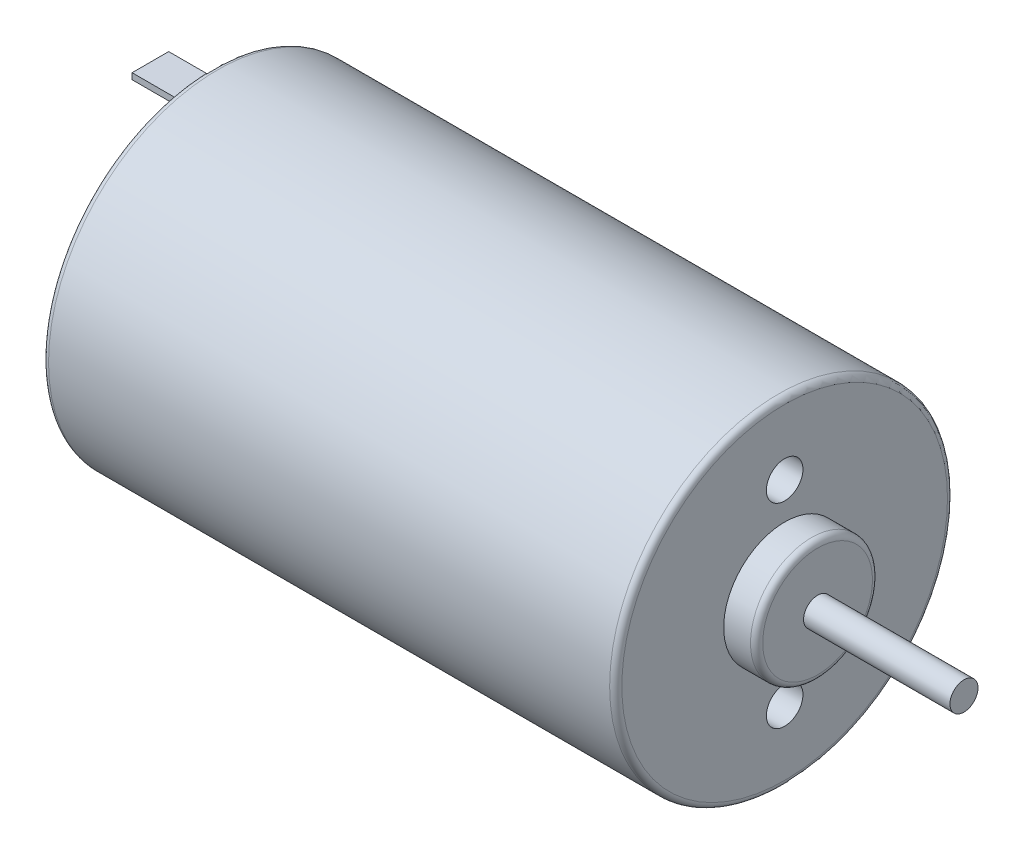
ISO-10303-21;
HEADER;
FILE_DESCRIPTION(('STEP AP214'),'2;1');
FILE_NAME('part.step','',(''),(''),'','','');
FILE_SCHEMA(('AUTOMOTIVE_DESIGN { 1 0 10303 214 1 1 1 1 }'));
ENDSEC;
DATA;
#1=APPLICATION_CONTEXT('core data for automotive mechanical design processes');
#2=APPLICATION_PROTOCOL_DEFINITION('international standard','automotive_design',2000,#1);
#3=PRODUCT_CONTEXT('',#1,'mechanical');
#4=PRODUCT('Part','Part','',(#3));
#5=PRODUCT_RELATED_PRODUCT_CATEGORY('part','',(#4));
#6=PRODUCT_DEFINITION_FORMATION('','',#4);
#7=PRODUCT_DEFINITION_CONTEXT('part definition',#1,'design');
#8=PRODUCT_DEFINITION('design','',#6,#7);
#9=PRODUCT_DEFINITION_SHAPE('','',#8);
#10=(LENGTH_UNIT() NAMED_UNIT(*) SI_UNIT(.MILLI.,.METRE.));
#11=(NAMED_UNIT(*) PLANE_ANGLE_UNIT() SI_UNIT($,.RADIAN.));
#12=(NAMED_UNIT(*) SI_UNIT($,.STERADIAN.) SOLID_ANGLE_UNIT());
#13=UNCERTAINTY_MEASURE_WITH_UNIT(LENGTH_MEASURE(1.E-05),#10,'distance_accuracy_value','');
#14=(GEOMETRIC_REPRESENTATION_CONTEXT(3) GLOBAL_UNCERTAINTY_ASSIGNED_CONTEXT((#13)) GLOBAL_UNIT_ASSIGNED_CONTEXT((#10,
#11,#12)) REPRESENTATION_CONTEXT('',''));
#15=CARTESIAN_POINT('',(0.,0.,0.));
#16=DIRECTION('',(0.,0.,1.));
#17=DIRECTION('',(1.,0.,0.));
#18=AXIS2_PLACEMENT_3D('',#15,#16,#17);
#19=CARTESIAN_POINT('',(0.,0.,0.));
#20=DIRECTION('',(1.,0.,0.));
#21=DIRECTION('',(0.,0.,-1.));
#22=AXIS2_PLACEMENT_3D('',#19,#20,#21);
#23=PLANE('',#22);
#24=CARTESIAN_POINT('',(0.,0.,0.));
#25=DIRECTION('',(1.,0.,0.));
#26=DIRECTION('',(0.,0.,-1.));
#27=AXIS2_PLACEMENT_3D('',#24,#25,#26);
#28=CIRCLE('',#27,13.35);
#29=CARTESIAN_POINT('',(0.,0.,-13.35));
#30=VERTEX_POINT('',#29);
#31=EDGE_CURVE('E50',#30,#30,#28,.F.);
#32=ORIENTED_EDGE('',*,*,#31,.T.);
#33=EDGE_LOOP('',(#32));
#34=FACE_BOUND('',#33,.T.);
#35=DIRECTION('',(0.,1.,0.));
#36=VECTOR('',#35,1.);
#37=CARTESIAN_POINT('',(0.,11.65,1.5));
#38=LINE('',#37,#36);
#39=CARTESIAN_POINT('',(0.,11.15,1.5));
#40=VERTEX_POINT('',#39);
#41=CARTESIAN_POINT('',(0.,11.65,1.5));
#42=VERTEX_POINT('',#41);
#43=EDGE_CURVE('E131',#40,#42,#38,.T.);
#44=ORIENTED_EDGE('',*,*,#43,.F.);
#45=DIRECTION('',(0.,0.,1.));
#46=VECTOR('',#45,1.);
#47=CARTESIAN_POINT('',(0.,11.15,-1.5));
#48=LINE('',#47,#46);
#49=CARTESIAN_POINT('',(0.,11.15,-1.5));
#50=VERTEX_POINT('',#49);
#51=EDGE_CURVE('E147',#50,#40,#48,.T.);
#52=ORIENTED_EDGE('',*,*,#51,.F.);
#53=DIRECTION('',(0.,-1.,0.));
#54=VECTOR('',#53,1.);
#55=CARTESIAN_POINT('',(0.,11.65,-1.5));
#56=LINE('',#55,#54);
#57=CARTESIAN_POINT('',(0.,11.65,-1.5));
#58=VERTEX_POINT('',#57);
#59=EDGE_CURVE('E160',#58,#50,#56,.T.);
#60=ORIENTED_EDGE('',*,*,#59,.F.);
#61=DIRECTION('',(0.,0.,-1.));
#62=VECTOR('',#61,1.);
#63=CARTESIAN_POINT('',(0.,11.65,-1.5));
#64=LINE('',#63,#62);
#65=EDGE_CURVE('E136',#42,#58,#64,.T.);
#66=ORIENTED_EDGE('',*,*,#65,.F.);
#67=EDGE_LOOP('',(#44,#52,#60,#66));
#68=FACE_BOUND('',#67,.T.);
#69=CARTESIAN_POINT('',(0.,0.,0.));
#70=DIRECTION('',(-1.,0.,0.));
#71=DIRECTION('',(0.,0.,1.));
#72=AXIS2_PLACEMENT_3D('',#69,#70,#71);
#73=CIRCLE('',#72,5.);
#74=CARTESIAN_POINT('',(0.,0.,5.));
#75=VERTEX_POINT('',#74);
#76=EDGE_CURVE('E192',#75,#75,#73,.T.);
#77=ORIENTED_EDGE('',*,*,#76,.F.);
#78=EDGE_LOOP('',(#77));
#79=FACE_BOUND('',#78,.T.);
#80=DIRECTION('',(0.,-1.,0.));
#81=VECTOR('',#80,1.);
#82=CARTESIAN_POINT('',(0.,-11.65,-1.5));
#83=LINE('',#82,#81);
#84=CARTESIAN_POINT('',(0.,-11.15,-1.5));
#85=VERTEX_POINT('',#84);
#86=CARTESIAN_POINT('',(0.,-11.65,-1.5));
#87=VERTEX_POINT('',#86);
#88=EDGE_CURVE('E129',#85,#87,#83,.T.);
#89=ORIENTED_EDGE('',*,*,#88,.F.);
#90=DIRECTION('',(0.,0.,-1.));
#91=VECTOR('',#90,1.);
#92=CARTESIAN_POINT('',(0.,-11.15,-1.5));
#93=LINE('',#92,#91);
#94=CARTESIAN_POINT('',(0.,-11.15,1.5));
#95=VERTEX_POINT('',#94);
#96=EDGE_CURVE('E126',#95,#85,#93,.T.);
#97=ORIENTED_EDGE('',*,*,#96,.F.);
#98=DIRECTION('',(0.,1.,0.));
#99=VECTOR('',#98,1.);
#100=CARTESIAN_POINT('',(0.,-11.65,1.5));
#101=LINE('',#100,#99);
#102=CARTESIAN_POINT('',(0.,-11.65,1.5));
#103=VERTEX_POINT('',#102);
#104=EDGE_CURVE('E62',#103,#95,#101,.T.);
#105=ORIENTED_EDGE('',*,*,#104,.F.);
#106=DIRECTION('',(0.,0.,1.));
#107=VECTOR('',#106,1.);
#108=CARTESIAN_POINT('',(0.,-11.65,-1.5));
#109=LINE('',#108,#107);
#110=EDGE_CURVE('E57',#87,#103,#109,.T.);
#111=ORIENTED_EDGE('',*,*,#110,.F.);
#112=EDGE_LOOP('',(#89,#97,#105,#111));
#113=FACE_BOUND('',#112,.T.);
#114=ADVANCED_FACE('F41',(#34,#68,#79,#113),#23,.F.);
#115=CARTESIAN_POINT('',(47.,0.,0.));
#116=DIRECTION('',(-1.,0.,0.));
#117=DIRECTION('',(0.,0.,1.));
#118=AXIS2_PLACEMENT_3D('',#115,#116,#117);
#119=CYLINDRICAL_SURFACE('',#118,13.85);
#120=CARTESIAN_POINT('',(0.5,0.,0.));
#121=DIRECTION('',(1.,0.,0.));
#122=DIRECTION('',(0.,0.,-1.));
#123=AXIS2_PLACEMENT_3D('',#120,#121,#122);
#124=CIRCLE('',#123,13.85);
#125=CARTESIAN_POINT('',(0.5,0.,-13.85));
#126=VERTEX_POINT('',#125);
#127=EDGE_CURVE('E226',#126,#126,#124,.T.);
#128=ORIENTED_EDGE('',*,*,#127,.T.);
#129=EDGE_LOOP('',(#128));
#130=FACE_BOUND('',#129,.T.);
#131=CARTESIAN_POINT('',(46.5,0.,0.));
#132=DIRECTION('',(1.,0.,0.));
#133=DIRECTION('',(0.,0.,-1.));
#134=AXIS2_PLACEMENT_3D('',#131,#132,#133);
#135=CIRCLE('',#134,13.85);
#136=CARTESIAN_POINT('',(46.5,0.,-13.85));
#137=VERTEX_POINT('',#136);
#138=EDGE_CURVE('E222',#137,#137,#135,.F.);
#139=ORIENTED_EDGE('',*,*,#138,.T.);
#140=EDGE_LOOP('',(#139));
#141=FACE_BOUND('',#140,.T.);
#142=ADVANCED_FACE('F241',(#130,#141),#119,.T.);
#143=CARTESIAN_POINT('',(47.,0.,0.));
#144=DIRECTION('',(1.,0.,0.));
#145=DIRECTION('',(0.,0.,-1.));
#146=AXIS2_PLACEMENT_3D('',#143,#144,#145);
#147=PLANE('',#146);
#148=CARTESIAN_POINT('',(47.,0.,0.));
#149=DIRECTION('',(1.,0.,0.));
#150=DIRECTION('',(0.,0.,-1.));
#151=AXIS2_PLACEMENT_3D('',#148,#149,#150);
#152=CIRCLE('',#151,13.35);
#153=CARTESIAN_POINT('',(47.,0.,-13.35));
#154=VERTEX_POINT('',#153);
#155=EDGE_CURVE('E11',#154,#154,#152,.T.);
#156=ORIENTED_EDGE('',*,*,#155,.T.);
#157=EDGE_LOOP('',(#156));
#158=FACE_BOUND('',#157,.T.);
#159=CARTESIAN_POINT('',(47.,8.,0.));
#160=DIRECTION('',(1.,0.,0.));
#161=DIRECTION('',(0.,0.,-1.));
#162=AXIS2_PLACEMENT_3D('',#159,#160,#161);
#163=CIRCLE('',#162,1.5);
#164=CARTESIAN_POINT('',(47.,8.,-1.5));
#165=VERTEX_POINT('',#164);
#166=EDGE_CURVE('E259',#165,#165,#163,.T.);
#167=ORIENTED_EDGE('',*,*,#166,.F.);
#168=EDGE_LOOP('',(#167));
#169=FACE_BOUND('',#168,.T.);
#170=CARTESIAN_POINT('',(47.,-8.,0.));
#171=DIRECTION('',(1.,0.,0.));
#172=DIRECTION('',(0.,0.,1.));
#173=AXIS2_PLACEMENT_3D('',#170,#171,#172);
#174=CIRCLE('',#173,1.5);
#175=CARTESIAN_POINT('',(47.,-8.,1.5));
#176=VERTEX_POINT('',#175);
#177=EDGE_CURVE('E263',#176,#176,#174,.T.);
#178=ORIENTED_EDGE('',*,*,#177,.F.);
#179=EDGE_LOOP('',(#178));
#180=FACE_BOUND('',#179,.T.);
#181=CARTESIAN_POINT('',(47.,0.,0.));
#182=DIRECTION('',(1.,0.,0.));
#183=DIRECTION('',(0.,0.,-1.));
#184=AXIS2_PLACEMENT_3D('',#181,#182,#183);
#185=CIRCLE('',#184,5.);
#186=CARTESIAN_POINT('',(47.,0.,-5.));
#187=VERTEX_POINT('',#186);
#188=EDGE_CURVE('E200',#187,#187,#185,.T.);
#189=ORIENTED_EDGE('',*,*,#188,.F.);
#190=EDGE_LOOP('',(#189));
#191=FACE_BOUND('',#190,.T.);
#192=ADVANCED_FACE('F244',(#158,#169,#180,#191),#147,.T.);
#193=CARTESIAN_POINT('',(49.7,0.,0.));
#194=DIRECTION('',(-1.,0.,0.));
#195=DIRECTION('',(0.,0.,1.));
#196=AXIS2_PLACEMENT_3D('',#193,#194,#195);
#197=CYLINDRICAL_SURFACE('',#196,5.);
#198=CARTESIAN_POINT('',(49.2,0.,0.));
#199=DIRECTION('',(1.,0.,0.));
#200=DIRECTION('',(0.,0.,-1.));
#201=AXIS2_PLACEMENT_3D('',#198,#199,#200);
#202=CIRCLE('',#201,5.);
#203=CARTESIAN_POINT('',(49.2,0.,-5.));
#204=VERTEX_POINT('',#203);
#205=EDGE_CURVE('E210',#204,#204,#202,.F.);
#206=ORIENTED_EDGE('',*,*,#205,.T.);
#207=EDGE_LOOP('',(#206));
#208=FACE_BOUND('',#207,.T.);
#209=ORIENTED_EDGE('',*,*,#188,.T.);
#210=EDGE_LOOP('',(#209));
#211=FACE_BOUND('',#210,.T.);
#212=ADVANCED_FACE('F254',(#208,#211),#197,.T.);
#213=CARTESIAN_POINT('',(49.7,0.,0.));
#214=DIRECTION('',(1.,0.,0.));
#215=DIRECTION('',(0.,0.,-1.));
#216=AXIS2_PLACEMENT_3D('',#213,#214,#215);
#217=PLANE('',#216);
#218=CARTESIAN_POINT('',(49.7,0.,0.));
#219=DIRECTION('',(1.,0.,0.));
#220=DIRECTION('',(0.,0.,-1.));
#221=AXIS2_PLACEMENT_3D('',#218,#219,#220);
#222=CIRCLE('',#221,4.5);
#223=CARTESIAN_POINT('',(49.7,0.,-4.5));
#224=VERTEX_POINT('',#223);
#225=EDGE_CURVE('E191',#224,#224,#222,.T.);
#226=ORIENTED_EDGE('',*,*,#225,.T.);
#227=EDGE_LOOP('',(#226));
#228=FACE_BOUND('',#227,.T.);
#229=CARTESIAN_POINT('',(49.7,0.,0.));
#230=DIRECTION('',(1.,0.,0.));
#231=DIRECTION('',(0.,0.,-1.));
#232=AXIS2_PLACEMENT_3D('',#229,#230,#231);
#233=CIRCLE('',#232,1.15);
#234=CARTESIAN_POINT('',(49.7,0.,-1.15));
#235=VERTEX_POINT('',#234);
#236=EDGE_CURVE('E196',#235,#235,#233,.T.);
#237=ORIENTED_EDGE('',*,*,#236,.F.);
#238=EDGE_LOOP('',(#237));
#239=FACE_BOUND('',#238,.T.);
#240=ADVANCED_FACE('F267',(#228,#239),#217,.T.);
#241=CARTESIAN_POINT('',(61.7,0.,0.));
#242=DIRECTION('',(-1.,0.,0.));
#243=DIRECTION('',(0.,0.,1.));
#244=AXIS2_PLACEMENT_3D('',#241,#242,#243);
#245=CYLINDRICAL_SURFACE('',#244,1.15);
#246=CARTESIAN_POINT('',(61.7,0.,0.));
#247=DIRECTION('',(1.,0.,0.));
#248=DIRECTION('',(0.,0.,-1.));
#249=AXIS2_PLACEMENT_3D('',#246,#247,#248);
#250=CIRCLE('',#249,1.15);
#251=CARTESIAN_POINT('',(61.7,0.,-1.15));
#252=VERTEX_POINT('',#251);
#253=EDGE_CURVE('E186',#252,#252,#250,.T.);
#254=ORIENTED_EDGE('',*,*,#253,.F.);
#255=EDGE_LOOP('',(#254));
#256=FACE_BOUND('',#255,.T.);
#257=ORIENTED_EDGE('',*,*,#236,.T.);
#258=EDGE_LOOP('',(#257));
#259=FACE_BOUND('',#258,.T.);
#260=ADVANCED_FACE('F273',(#256,#259),#245,.T.);
#261=CARTESIAN_POINT('',(61.7,0.,0.));
#262=DIRECTION('',(1.,0.,0.));
#263=DIRECTION('',(0.,0.,-1.));
#264=AXIS2_PLACEMENT_3D('',#261,#262,#263);
#265=PLANE('',#264);
#266=ORIENTED_EDGE('',*,*,#253,.T.);
#267=EDGE_LOOP('',(#266));
#268=FACE_BOUND('',#267,.T.);
#269=ADVANCED_FACE('F317',(#268),#265,.T.);
#270=CARTESIAN_POINT('',(-2.,0.,0.));
#271=DIRECTION('',(1.,0.,0.));
#272=DIRECTION('',(0.,0.,-1.));
#273=AXIS2_PLACEMENT_3D('',#270,#271,#272);
#274=CYLINDRICAL_SURFACE('',#273,5.);
#275=CARTESIAN_POINT('',(-1.5,0.,0.));
#276=DIRECTION('',(-1.,0.,0.));
#277=DIRECTION('',(0.,0.,1.));
#278=AXIS2_PLACEMENT_3D('',#275,#276,#277);
#279=CIRCLE('',#278,5.);
#280=CARTESIAN_POINT('',(-1.5,0.,5.));
#281=VERTEX_POINT('',#280);
#282=EDGE_CURVE('E218',#281,#281,#279,.F.);
#283=ORIENTED_EDGE('',*,*,#282,.T.);
#284=EDGE_LOOP('',(#283));
#285=FACE_BOUND('',#284,.T.);
#286=ORIENTED_EDGE('',*,*,#76,.T.);
#287=EDGE_LOOP('',(#286));
#288=FACE_BOUND('',#287,.T.);
#289=ADVANCED_FACE('F298',(#285,#288),#274,.T.);
#290=CARTESIAN_POINT('',(-2.,0.,0.));
#291=DIRECTION('',(-1.,0.,0.));
#292=DIRECTION('',(0.,0.,1.));
#293=AXIS2_PLACEMENT_3D('',#290,#291,#292);
#294=PLANE('',#293);
#295=CARTESIAN_POINT('',(-2.,0.,0.));
#296=DIRECTION('',(-1.,0.,0.));
#297=DIRECTION('',(0.,0.,1.));
#298=AXIS2_PLACEMENT_3D('',#295,#296,#297);
#299=CIRCLE('',#298,4.5);
#300=CARTESIAN_POINT('',(-2.,0.,4.5));
#301=VERTEX_POINT('',#300);
#302=EDGE_CURVE('E214',#301,#301,#299,.T.);
#303=ORIENTED_EDGE('',*,*,#302,.T.);
#304=EDGE_LOOP('',(#303));
#305=FACE_BOUND('',#304,.T.);
#306=CARTESIAN_POINT('',(-2.,0.,0.));
#307=DIRECTION('',(-1.,0.,0.));
#308=DIRECTION('',(0.,0.,1.));
#309=AXIS2_PLACEMENT_3D('',#306,#307,#308);
#310=CIRCLE('',#309,1.15);
#311=CARTESIAN_POINT('',(-2.,0.,1.15));
#312=VERTEX_POINT('',#311);
#313=EDGE_CURVE('E187',#312,#312,#310,.T.);
#314=ORIENTED_EDGE('',*,*,#313,.F.);
#315=EDGE_LOOP('',(#314));
#316=FACE_BOUND('',#315,.T.);
#317=ADVANCED_FACE('F294',(#305,#316),#294,.T.);
#318=CARTESIAN_POINT('',(-2.75,0.,0.));
#319=DIRECTION('',(1.,0.,0.));
#320=DIRECTION('',(0.,0.,-1.));
#321=AXIS2_PLACEMENT_3D('',#318,#319,#320);
#322=CYLINDRICAL_SURFACE('',#321,1.15);
#323=CARTESIAN_POINT('',(-2.75,0.,0.));
#324=DIRECTION('',(-1.,0.,0.));
#325=DIRECTION('',(0.,0.,1.));
#326=AXIS2_PLACEMENT_3D('',#323,#324,#325);
#327=CIRCLE('',#326,1.15);
#328=CARTESIAN_POINT('',(-2.75,0.,1.15));
#329=VERTEX_POINT('',#328);
#330=EDGE_CURVE('E182',#329,#329,#327,.T.);
#331=ORIENTED_EDGE('',*,*,#330,.F.);
#332=EDGE_LOOP('',(#331));
#333=FACE_BOUND('',#332,.T.);
#334=ORIENTED_EDGE('',*,*,#313,.T.);
#335=EDGE_LOOP('',(#334));
#336=FACE_BOUND('',#335,.T.);
#337=ADVANCED_FACE('F297',(#333,#336),#322,.T.);
#338=CARTESIAN_POINT('',(-2.75,0.,0.));
#339=DIRECTION('',(-1.,0.,0.));
#340=DIRECTION('',(0.,0.,1.));
#341=AXIS2_PLACEMENT_3D('',#338,#339,#340);
#342=PLANE('',#341);
#343=ORIENTED_EDGE('',*,*,#330,.T.);
#344=EDGE_LOOP('',(#343));
#345=FACE_BOUND('',#344,.T.);
#346=ADVANCED_FACE('F303',(#345),#342,.T.);
#347=CARTESIAN_POINT('',(-5.,11.65,1.5));
#348=DIRECTION('',(0.,0.,-1.));
#349=DIRECTION('',(-1.,0.,0.));
#350=AXIS2_PLACEMENT_3D('',#347,#348,#349);
#351=PLANE('',#350);
#352=ORIENTED_EDGE('',*,*,#43,.T.);
#353=DIRECTION('',(1.,0.,0.));
#354=VECTOR('',#353,1.);
#355=CARTESIAN_POINT('',(-5.,11.65,1.5));
#356=LINE('',#355,#354);
#357=CARTESIAN_POINT('',(-5.,11.65,1.5));
#358=VERTEX_POINT('',#357);
#359=EDGE_CURVE('E178',#358,#42,#356,.T.);
#360=ORIENTED_EDGE('',*,*,#359,.F.);
#361=DIRECTION('',(0.,1.,0.));
#362=VECTOR('',#361,1.);
#363=CARTESIAN_POINT('',(-5.,11.65,1.5));
#364=LINE('',#363,#362);
#365=CARTESIAN_POINT('',(-5.,11.15,1.5));
#366=VERTEX_POINT('',#365);
#367=EDGE_CURVE('E142',#366,#358,#364,.T.);
#368=ORIENTED_EDGE('',*,*,#367,.F.);
#369=DIRECTION('',(1.,0.,0.));
#370=VECTOR('',#369,1.);
#371=CARTESIAN_POINT('',(-5.,11.15,1.5));
#372=LINE('',#371,#370);
#373=EDGE_CURVE('E155',#366,#40,#372,.T.);
#374=ORIENTED_EDGE('',*,*,#373,.T.);
#375=EDGE_LOOP('',(#352,#360,#368,#374));
#376=FACE_BOUND('',#375,.T.);
#377=ADVANCED_FACE('F309',(#376),#351,.F.);
#378=CARTESIAN_POINT('',(-5.,11.65,-1.5));
#379=DIRECTION('',(0.,-1.,0.));
#380=DIRECTION('',(0.,0.,-1.));
#381=AXIS2_PLACEMENT_3D('',#378,#379,#380);
#382=PLANE('',#381);
#383=ORIENTED_EDGE('',*,*,#65,.T.);
#384=DIRECTION('',(1.,0.,0.));
#385=VECTOR('',#384,1.);
#386=CARTESIAN_POINT('',(-5.,11.65,-1.5));
#387=LINE('',#386,#385);
#388=CARTESIAN_POINT('',(-5.,11.65,-1.5));
#389=VERTEX_POINT('',#388);
#390=EDGE_CURVE('E174',#389,#58,#387,.T.);
#391=ORIENTED_EDGE('',*,*,#390,.F.);
#392=DIRECTION('',(0.,0.,-1.));
#393=VECTOR('',#392,1.);
#394=CARTESIAN_POINT('',(-5.,11.65,-1.5));
#395=LINE('',#394,#393);
#396=EDGE_CURVE('E146',#358,#389,#395,.T.);
#397=ORIENTED_EDGE('',*,*,#396,.F.);
#398=ORIENTED_EDGE('',*,*,#359,.T.);
#399=EDGE_LOOP('',(#383,#391,#397,#398));
#400=FACE_BOUND('',#399,.T.);
#401=ADVANCED_FACE('F457',(#400),#382,.F.);
#402=CARTESIAN_POINT('',(-5.,11.65,-1.5));
#403=DIRECTION('',(0.,0.,1.));
#404=DIRECTION('',(1.,0.,0.));
#405=AXIS2_PLACEMENT_3D('',#402,#403,#404);
#406=PLANE('',#405);
#407=ORIENTED_EDGE('',*,*,#59,.T.);
#408=DIRECTION('',(1.,0.,0.));
#409=VECTOR('',#408,1.);
#410=CARTESIAN_POINT('',(-5.,11.15,-1.5));
#411=LINE('',#410,#409);
#412=CARTESIAN_POINT('',(-5.,11.15,-1.5));
#413=VERTEX_POINT('',#412);
#414=EDGE_CURVE('E170',#413,#50,#411,.T.);
#415=ORIENTED_EDGE('',*,*,#414,.F.);
#416=DIRECTION('',(0.,-1.,0.));
#417=VECTOR('',#416,1.);
#418=CARTESIAN_POINT('',(-5.,11.65,-1.5));
#419=LINE('',#418,#417);
#420=EDGE_CURVE('E150',#389,#413,#419,.T.);
#421=ORIENTED_EDGE('',*,*,#420,.F.);
#422=ORIENTED_EDGE('',*,*,#390,.T.);
#423=EDGE_LOOP('',(#407,#415,#421,#422));
#424=FACE_BOUND('',#423,.T.);
#425=ADVANCED_FACE('F449',(#424),#406,.F.);
#426=CARTESIAN_POINT('',(-5.,11.15,-1.5));
#427=DIRECTION('',(0.,1.,0.));
#428=DIRECTION('',(0.,0.,1.));
#429=AXIS2_PLACEMENT_3D('',#426,#427,#428);
#430=PLANE('',#429);
#431=ORIENTED_EDGE('',*,*,#51,.T.);
#432=ORIENTED_EDGE('',*,*,#373,.F.);
#433=DIRECTION('',(0.,0.,1.));
#434=VECTOR('',#433,1.);
#435=CARTESIAN_POINT('',(-5.,11.15,-1.5));
#436=LINE('',#435,#434);
#437=EDGE_CURVE('E153',#413,#366,#436,.T.);
#438=ORIENTED_EDGE('',*,*,#437,.F.);
#439=ORIENTED_EDGE('',*,*,#414,.T.);
#440=EDGE_LOOP('',(#431,#432,#438,#439));
#441=FACE_BOUND('',#440,.T.);
#442=ADVANCED_FACE('F441',(#441),#430,.F.);
#443=CARTESIAN_POINT('',(-5.,0.,0.));
#444=DIRECTION('',(-1.,0.,0.));
#445=DIRECTION('',(0.,0.,1.));
#446=AXIS2_PLACEMENT_3D('',#443,#444,#445);
#447=PLANE('',#446);
#448=ORIENTED_EDGE('',*,*,#367,.T.);
#449=ORIENTED_EDGE('',*,*,#396,.T.);
#450=ORIENTED_EDGE('',*,*,#420,.T.);
#451=ORIENTED_EDGE('',*,*,#437,.T.);
#452=EDGE_LOOP('',(#448,#449,#450,#451));
#453=FACE_BOUND('',#452,.T.);
#454=ADVANCED_FACE('F434',(#453),#447,.T.);
#455=CARTESIAN_POINT('',(-5.,-11.65,-1.5));
#456=DIRECTION('',(0.,0.,1.));
#457=DIRECTION('',(1.,0.,0.));
#458=AXIS2_PLACEMENT_3D('',#455,#456,#457);
#459=PLANE('',#458);
#460=ORIENTED_EDGE('',*,*,#88,.T.);
#461=DIRECTION('',(1.,0.,0.));
#462=VECTOR('',#461,1.);
#463=CARTESIAN_POINT('',(-5.,-11.65,-1.5));
#464=LINE('',#463,#462);
#465=CARTESIAN_POINT('',(-5.,-11.65,-1.5));
#466=VERTEX_POINT('',#465);
#467=EDGE_CURVE('E108',#466,#87,#464,.T.);
#468=ORIENTED_EDGE('',*,*,#467,.F.);
#469=DIRECTION('',(0.,-1.,0.));
#470=VECTOR('',#469,1.);
#471=CARTESIAN_POINT('',(-5.,-11.65,-1.5));
#472=LINE('',#471,#470);
#473=CARTESIAN_POINT('',(-5.,-11.15,-1.5));
#474=VERTEX_POINT('',#473);
#475=EDGE_CURVE('E116',#474,#466,#472,.T.);
#476=ORIENTED_EDGE('',*,*,#475,.F.);
#477=DIRECTION('',(1.,0.,0.));
#478=VECTOR('',#477,1.);
#479=CARTESIAN_POINT('',(-5.,-11.15,-1.5));
#480=LINE('',#479,#478);
#481=EDGE_CURVE('E555',#474,#85,#480,.T.);
#482=ORIENTED_EDGE('',*,*,#481,.T.);
#483=EDGE_LOOP('',(#460,#468,#476,#482));
#484=FACE_BOUND('',#483,.T.);
#485=ADVANCED_FACE('F128',(#484),#459,.F.);
#486=CARTESIAN_POINT('',(-5.,-11.65,-1.5));
#487=DIRECTION('',(0.,1.,0.));
#488=DIRECTION('',(0.,0.,1.));
#489=AXIS2_PLACEMENT_3D('',#486,#487,#488);
#490=PLANE('',#489);
#491=ORIENTED_EDGE('',*,*,#110,.T.);
#492=DIRECTION('',(1.,0.,0.));
#493=VECTOR('',#492,1.);
#494=CARTESIAN_POINT('',(-5.,-11.65,1.5));
#495=LINE('',#494,#493);
#496=CARTESIAN_POINT('',(-5.,-11.65,1.5));
#497=VERTEX_POINT('',#496);
#498=EDGE_CURVE('E111',#497,#103,#495,.T.);
#499=ORIENTED_EDGE('',*,*,#498,.F.);
#500=DIRECTION('',(0.,0.,1.));
#501=VECTOR('',#500,1.);
#502=CARTESIAN_POINT('',(-5.,-11.65,-1.5));
#503=LINE('',#502,#501);
#504=EDGE_CURVE('E104',#466,#497,#503,.T.);
#505=ORIENTED_EDGE('',*,*,#504,.F.);
#506=ORIENTED_EDGE('',*,*,#467,.T.);
#507=EDGE_LOOP('',(#491,#499,#505,#506));
#508=FACE_BOUND('',#507,.T.);
#509=ADVANCED_FACE('F106',(#508),#490,.F.);
#510=CARTESIAN_POINT('',(-5.,-11.65,1.5));
#511=DIRECTION('',(0.,0.,-1.));
#512=DIRECTION('',(-1.,0.,0.));
#513=AXIS2_PLACEMENT_3D('',#510,#511,#512);
#514=PLANE('',#513);
#515=ORIENTED_EDGE('',*,*,#104,.T.);
#516=DIRECTION('',(1.,0.,0.));
#517=VECTOR('',#516,1.);
#518=CARTESIAN_POINT('',(-5.,-11.15,1.5));
#519=LINE('',#518,#517);
#520=CARTESIAN_POINT('',(-5.,-11.15,1.5));
#521=VERTEX_POINT('',#520);
#522=EDGE_CURVE('E138',#521,#95,#519,.T.);
#523=ORIENTED_EDGE('',*,*,#522,.F.);
#524=DIRECTION('',(0.,1.,0.));
#525=VECTOR('',#524,1.);
#526=CARTESIAN_POINT('',(-5.,-11.65,1.5));
#527=LINE('',#526,#525);
#528=EDGE_CURVE('E115',#497,#521,#527,.T.);
#529=ORIENTED_EDGE('',*,*,#528,.F.);
#530=ORIENTED_EDGE('',*,*,#498,.T.);
#531=EDGE_LOOP('',(#515,#523,#529,#530));
#532=FACE_BOUND('',#531,.T.);
#533=ADVANCED_FACE('F413',(#532),#514,.F.);
#534=CARTESIAN_POINT('',(-5.,-11.15,-1.5));
#535=DIRECTION('',(0.,-1.,0.));
#536=DIRECTION('',(0.,0.,-1.));
#537=AXIS2_PLACEMENT_3D('',#534,#535,#536);
#538=PLANE('',#537);
#539=ORIENTED_EDGE('',*,*,#96,.T.);
#540=ORIENTED_EDGE('',*,*,#481,.F.);
#541=DIRECTION('',(0.,0.,-1.));
#542=VECTOR('',#541,1.);
#543=CARTESIAN_POINT('',(-5.,-11.15,-1.5));
#544=LINE('',#543,#542);
#545=EDGE_CURVE('E121',#521,#474,#544,.T.);
#546=ORIENTED_EDGE('',*,*,#545,.F.);
#547=ORIENTED_EDGE('',*,*,#522,.T.);
#548=EDGE_LOOP('',(#539,#540,#546,#547));
#549=FACE_BOUND('',#548,.T.);
#550=ADVANCED_FACE('F406',(#549),#538,.F.);
#551=CARTESIAN_POINT('',(-5.,0.,0.));
#552=DIRECTION('',(1.,0.,0.));
#553=DIRECTION('',(0.,0.,-1.));
#554=AXIS2_PLACEMENT_3D('',#551,#552,#553);
#555=PLANE('',#554);
#556=ORIENTED_EDGE('',*,*,#475,.T.);
#557=ORIENTED_EDGE('',*,*,#504,.T.);
#558=ORIENTED_EDGE('',*,*,#528,.T.);
#559=ORIENTED_EDGE('',*,*,#545,.T.);
#560=EDGE_LOOP('',(#556,#557,#558,#559));
#561=FACE_BOUND('',#560,.T.);
#562=ADVANCED_FACE('F119',(#561),#555,.F.);
#563=CARTESIAN_POINT('',(42.,-8.,0.));
#564=DIRECTION('',(1.,0.,0.));
#565=DIRECTION('',(0.,0.,-1.));
#566=AXIS2_PLACEMENT_3D('',#563,#564,#565);
#567=CYLINDRICAL_SURFACE('',#566,1.5);
#568=CARTESIAN_POINT('',(42.,-8.,0.));
#569=DIRECTION('',(1.,0.,0.));
#570=DIRECTION('',(0.,0.,1.));
#571=AXIS2_PLACEMENT_3D('',#568,#569,#570);
#572=CIRCLE('',#571,1.5);
#573=CARTESIAN_POINT('',(42.,-8.,1.5));
#574=VERTEX_POINT('',#573);
#575=EDGE_CURVE('E573',#574,#574,#572,.T.);
#576=ORIENTED_EDGE('',*,*,#575,.F.);
#577=EDGE_LOOP('',(#576));
#578=FACE_BOUND('',#577,.T.);
#579=ORIENTED_EDGE('',*,*,#177,.T.);
#580=EDGE_LOOP('',(#579));
#581=FACE_BOUND('',#580,.T.);
#582=ADVANCED_FACE('F391',(#578,#581),#567,.F.);
#583=CARTESIAN_POINT('',(42.,-8.,0.));
#584=DIRECTION('',(-1.,0.,0.));
#585=DIRECTION('',(0.,0.,1.));
#586=AXIS2_PLACEMENT_3D('',#583,#584,#585);
#587=PLANE('',#586);
#588=ORIENTED_EDGE('',*,*,#575,.T.);
#589=EDGE_LOOP('',(#588));
#590=FACE_BOUND('',#589,.T.);
#591=ADVANCED_FACE('F383',(#590),#587,.F.);
#592=CARTESIAN_POINT('',(42.,8.,0.));
#593=DIRECTION('',(1.,0.,0.));
#594=DIRECTION('',(0.,0.,-1.));
#595=AXIS2_PLACEMENT_3D('',#592,#593,#594);
#596=CYLINDRICAL_SURFACE('',#595,1.5);
#597=CARTESIAN_POINT('',(42.,8.,0.));
#598=DIRECTION('',(1.,0.,0.));
#599=DIRECTION('',(0.,0.,-1.));
#600=AXIS2_PLACEMENT_3D('',#597,#598,#599);
#601=CIRCLE('',#600,1.5);
#602=CARTESIAN_POINT('',(42.,8.,-1.5));
#603=VERTEX_POINT('',#602);
#604=EDGE_CURVE('E552',#603,#603,#601,.T.);
#605=ORIENTED_EDGE('',*,*,#604,.F.);
#606=EDGE_LOOP('',(#605));
#607=FACE_BOUND('',#606,.T.);
#608=ORIENTED_EDGE('',*,*,#166,.T.);
#609=EDGE_LOOP('',(#608));
#610=FACE_BOUND('',#609,.T.);
#611=ADVANCED_FACE('F376',(#607,#610),#596,.F.);
#612=CARTESIAN_POINT('',(42.,8.,0.));
#613=DIRECTION('',(1.,0.,0.));
#614=DIRECTION('',(0.,0.,-1.));
#615=AXIS2_PLACEMENT_3D('',#612,#613,#614);
#616=PLANE('',#615);
#617=ORIENTED_EDGE('',*,*,#604,.T.);
#618=EDGE_LOOP('',(#617));
#619=FACE_BOUND('',#618,.T.);
#620=ADVANCED_FACE('F284',(#619),#616,.T.);
#621=CARTESIAN_POINT('',(49.2,0.,0.));
#622=DIRECTION('',(1.,0.,0.));
#623=DIRECTION('',(0.,0.,-1.));
#624=AXIS2_PLACEMENT_3D('',#621,#622,#623);
#625=TOROIDAL_SURFACE('',#624,4.5,0.5);
#626=ORIENTED_EDGE('',*,*,#205,.F.);
#627=EDGE_LOOP('',(#626));
#628=FACE_BOUND('',#627,.T.);
#629=ORIENTED_EDGE('',*,*,#225,.F.);
#630=EDGE_LOOP('',(#629));
#631=FACE_BOUND('',#630,.T.);
#632=ADVANCED_FACE('F281',(#628,#631),#625,.T.);
#633=CARTESIAN_POINT('',(-1.5,0.,0.));
#634=DIRECTION('',(-1.,0.,0.));
#635=DIRECTION('',(0.,0.,1.));
#636=AXIS2_PLACEMENT_3D('',#633,#634,#635);
#637=TOROIDAL_SURFACE('',#636,4.5,0.5);
#638=ORIENTED_EDGE('',*,*,#282,.F.);
#639=EDGE_LOOP('',(#638));
#640=FACE_BOUND('',#639,.T.);
#641=ORIENTED_EDGE('',*,*,#302,.F.);
#642=EDGE_LOOP('',(#641));
#643=FACE_BOUND('',#642,.T.);
#644=ADVANCED_FACE('F238',(#640,#643),#637,.T.);
#645=CARTESIAN_POINT('',(0.5,0.,0.));
#646=DIRECTION('',(1.,0.,0.));
#647=DIRECTION('',(0.,0.,-1.));
#648=AXIS2_PLACEMENT_3D('',#645,#646,#647);
#649=TOROIDAL_SURFACE('',#648,13.35,0.5);
#650=ORIENTED_EDGE('',*,*,#31,.F.);
#651=EDGE_LOOP('',(#650));
#652=FACE_BOUND('',#651,.T.);
#653=ORIENTED_EDGE('',*,*,#127,.F.);
#654=EDGE_LOOP('',(#653));
#655=FACE_BOUND('',#654,.T.);
#656=ADVANCED_FACE('F235',(#652,#655),#649,.T.);
#657=CARTESIAN_POINT('',(46.5,0.,0.));
#658=DIRECTION('',(1.,0.,0.));
#659=DIRECTION('',(0.,0.,-1.));
#660=AXIS2_PLACEMENT_3D('',#657,#658,#659);
#661=TOROIDAL_SURFACE('',#660,13.35,0.5);
#662=ORIENTED_EDGE('',*,*,#138,.F.);
#663=EDGE_LOOP('',(#662));
#664=FACE_BOUND('',#663,.T.);
#665=ORIENTED_EDGE('',*,*,#155,.F.);
#666=EDGE_LOOP('',(#665));
#667=FACE_BOUND('',#666,.T.);
#668=ADVANCED_FACE('F43',(#664,#667),#661,.T.);
#669=CLOSED_SHELL('',(#114,#142,#192,#212,#240,#260,#269,#289,#317,#337,#346,#377,#401,#425,
#442,#454,#485,#509,#533,#550,#562,#582,#591,#611,#620,#632,#644,#656,#668));
#670=MANIFOLD_SOLID_BREP('B2',#669);
#671=ADVANCED_BREP_SHAPE_REPRESENTATION('',(#18,#670),#14);
#672=SHAPE_DEFINITION_REPRESENTATION(#9,#671);
ENDSEC;
END-ISO-10303-21;
